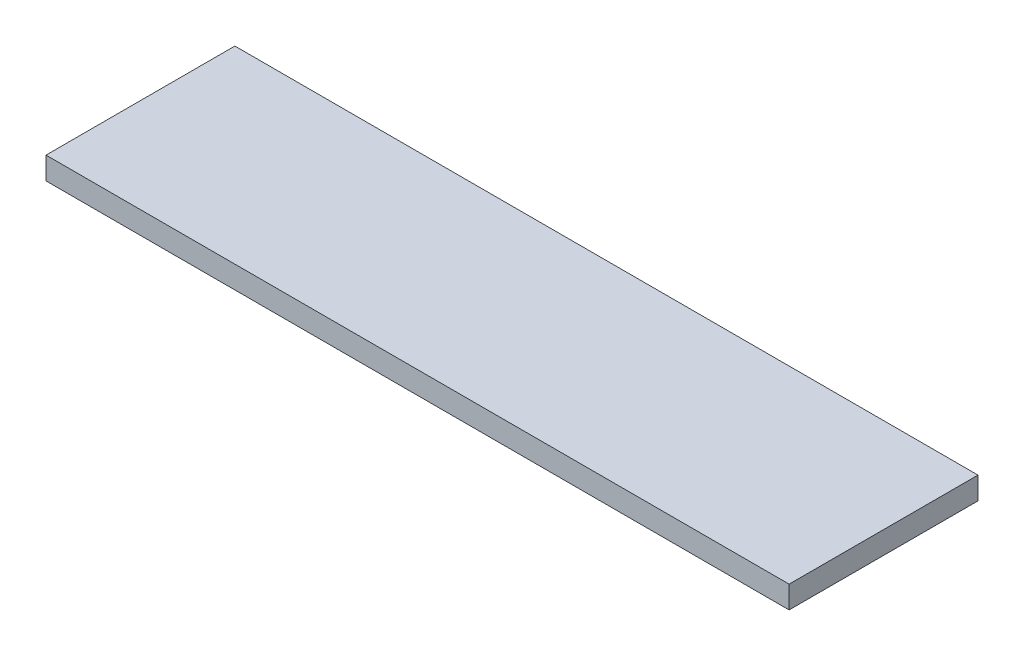
ISO-10303-21;
HEADER;
FILE_DESCRIPTION(('STEP AP214'),'2;1');
FILE_NAME('part.step','',(''),(''),'','','');
FILE_SCHEMA(('AUTOMOTIVE_DESIGN { 1 0 10303 214 1 1 1 1 }'));
ENDSEC;
DATA;
#1=APPLICATION_CONTEXT('core data for automotive mechanical design processes');
#2=APPLICATION_PROTOCOL_DEFINITION('international standard','automotive_design',2000,#1);
#3=PRODUCT_CONTEXT('',#1,'mechanical');
#4=PRODUCT('Part','Part','',(#3));
#5=PRODUCT_RELATED_PRODUCT_CATEGORY('part','',(#4));
#6=PRODUCT_DEFINITION_FORMATION('','',#4);
#7=PRODUCT_DEFINITION_CONTEXT('part definition',#1,'design');
#8=PRODUCT_DEFINITION('design','',#6,#7);
#9=PRODUCT_DEFINITION_SHAPE('','',#8);
#10=(LENGTH_UNIT() NAMED_UNIT(*) SI_UNIT(.MILLI.,.METRE.));
#11=(NAMED_UNIT(*) PLANE_ANGLE_UNIT() SI_UNIT($,.RADIAN.));
#12=(NAMED_UNIT(*) SI_UNIT($,.STERADIAN.) SOLID_ANGLE_UNIT());
#13=UNCERTAINTY_MEASURE_WITH_UNIT(LENGTH_MEASURE(1.E-05),#10,'distance_accuracy_value','');
#14=(GEOMETRIC_REPRESENTATION_CONTEXT(3) GLOBAL_UNCERTAINTY_ASSIGNED_CONTEXT((#13)) GLOBAL_UNIT_ASSIGNED_CONTEXT((#10,
#11,#12)) REPRESENTATION_CONTEXT('',''));
#15=CARTESIAN_POINT('',(0.,0.,0.));
#16=DIRECTION('',(0.,0.,1.));
#17=DIRECTION('',(1.,0.,0.));
#18=AXIS2_PLACEMENT_3D('',#15,#16,#17);
#19=CARTESIAN_POINT('',(-299.,18.,76.));
#20=DIRECTION('',(1.,0.,0.));
#21=DIRECTION('',(0.,0.,-1.));
#22=AXIS2_PLACEMENT_3D('',#19,#20,#21);
#23=PLANE('',#22);
#24=DIRECTION('',(0.,0.,1.));
#25=VECTOR('',#24,1.);
#26=CARTESIAN_POINT('',(-299.,0.,76.));
#27=LINE('',#26,#25);
#28=CARTESIAN_POINT('',(-299.,0.,-76.));
#29=VERTEX_POINT('',#28);
#30=CARTESIAN_POINT('',(-299.,0.,76.));
#31=VERTEX_POINT('',#30);
#32=EDGE_CURVE('E98',#29,#31,#27,.T.);
#33=ORIENTED_EDGE('',*,*,#32,.T.);
#34=DIRECTION('',(0.,-1.,0.));
#35=VECTOR('',#34,1.);
#36=CARTESIAN_POINT('',(-299.,18.,76.));
#37=LINE('',#36,#35);
#38=CARTESIAN_POINT('',(-299.,18.,76.));
#39=VERTEX_POINT('',#38);
#40=EDGE_CURVE('E11',#39,#31,#37,.T.);
#41=ORIENTED_EDGE('',*,*,#40,.F.);
#42=DIRECTION('',(0.,0.,1.));
#43=VECTOR('',#42,1.);
#44=CARTESIAN_POINT('',(-299.,18.,76.));
#45=LINE('',#44,#43);
#46=CARTESIAN_POINT('',(-299.,18.,-76.));
#47=VERTEX_POINT('',#46);
#48=EDGE_CURVE('E86',#47,#39,#45,.T.);
#49=ORIENTED_EDGE('',*,*,#48,.F.);
#50=DIRECTION('',(0.,-1.,0.));
#51=VECTOR('',#50,1.);
#52=CARTESIAN_POINT('',(-299.,18.,-76.));
#53=LINE('',#52,#51);
#54=EDGE_CURVE('E94',#47,#29,#53,.T.);
#55=ORIENTED_EDGE('',*,*,#54,.T.);
#56=EDGE_LOOP('',(#33,#41,#49,#55));
#57=FACE_BOUND('',#56,.T.);
#58=ADVANCED_FACE('F35',(#57),#23,.F.);
#59=CARTESIAN_POINT('',(299.,18.,76.));
#60=DIRECTION('',(0.,0.,-1.));
#61=DIRECTION('',(-1.,0.,0.));
#62=AXIS2_PLACEMENT_3D('',#59,#60,#61);
#63=PLANE('',#62);
#64=DIRECTION('',(1.,0.,0.));
#65=VECTOR('',#64,1.);
#66=CARTESIAN_POINT('',(299.,0.,76.));
#67=LINE('',#66,#65);
#68=CARTESIAN_POINT('',(299.,0.,76.));
#69=VERTEX_POINT('',#68);
#70=EDGE_CURVE('E90',#31,#69,#67,.T.);
#71=ORIENTED_EDGE('',*,*,#70,.T.);
#72=DIRECTION('',(0.,-1.,0.));
#73=VECTOR('',#72,1.);
#74=CARTESIAN_POINT('',(299.,18.,76.));
#75=LINE('',#74,#73);
#76=CARTESIAN_POINT('',(299.,18.,76.));
#77=VERTEX_POINT('',#76);
#78=EDGE_CURVE('E43',#77,#69,#75,.T.);
#79=ORIENTED_EDGE('',*,*,#78,.F.);
#80=DIRECTION('',(1.,0.,0.));
#81=VECTOR('',#80,1.);
#82=CARTESIAN_POINT('',(299.,18.,76.));
#83=LINE('',#82,#81);
#84=EDGE_CURVE('E81',#39,#77,#83,.T.);
#85=ORIENTED_EDGE('',*,*,#84,.F.);
#86=ORIENTED_EDGE('',*,*,#40,.T.);
#87=EDGE_LOOP('',(#71,#79,#85,#86));
#88=FACE_BOUND('',#87,.T.);
#89=ADVANCED_FACE('F89',(#88),#63,.F.);
#90=CARTESIAN_POINT('',(299.,18.,76.));
#91=DIRECTION('',(-1.,0.,0.));
#92=DIRECTION('',(0.,0.,1.));
#93=AXIS2_PLACEMENT_3D('',#90,#91,#92);
#94=PLANE('',#93);
#95=DIRECTION('',(0.,0.,-1.));
#96=VECTOR('',#95,1.);
#97=CARTESIAN_POINT('',(299.,0.,76.));
#98=LINE('',#97,#96);
#99=CARTESIAN_POINT('',(299.,0.,-76.));
#100=VERTEX_POINT('',#99);
#101=EDGE_CURVE('E68',#69,#100,#98,.T.);
#102=ORIENTED_EDGE('',*,*,#101,.T.);
#103=DIRECTION('',(0.,-1.,0.));
#104=VECTOR('',#103,1.);
#105=CARTESIAN_POINT('',(299.,18.,-76.));
#106=LINE('',#105,#104);
#107=CARTESIAN_POINT('',(299.,18.,-76.));
#108=VERTEX_POINT('',#107);
#109=EDGE_CURVE('E91',#108,#100,#106,.T.);
#110=ORIENTED_EDGE('',*,*,#109,.F.);
#111=DIRECTION('',(0.,0.,-1.));
#112=VECTOR('',#111,1.);
#113=CARTESIAN_POINT('',(299.,18.,76.));
#114=LINE('',#113,#112);
#115=EDGE_CURVE('E84',#77,#108,#114,.T.);
#116=ORIENTED_EDGE('',*,*,#115,.F.);
#117=ORIENTED_EDGE('',*,*,#78,.T.);
#118=EDGE_LOOP('',(#102,#110,#116,#117));
#119=FACE_BOUND('',#118,.T.);
#120=ADVANCED_FACE('F92',(#119),#94,.F.);
#121=CARTESIAN_POINT('',(299.,18.,-76.));
#122=DIRECTION('',(0.,0.,1.));
#123=DIRECTION('',(1.,0.,0.));
#124=AXIS2_PLACEMENT_3D('',#121,#122,#123);
#125=PLANE('',#124);
#126=DIRECTION('',(-1.,0.,0.));
#127=VECTOR('',#126,1.);
#128=CARTESIAN_POINT('',(299.,0.,-76.));
#129=LINE('',#128,#127);
#130=EDGE_CURVE('E74',#100,#29,#129,.T.);
#131=ORIENTED_EDGE('',*,*,#130,.T.);
#132=ORIENTED_EDGE('',*,*,#54,.F.);
#133=DIRECTION('',(-1.,0.,0.));
#134=VECTOR('',#133,1.);
#135=CARTESIAN_POINT('',(299.,18.,-76.));
#136=LINE('',#135,#134);
#137=EDGE_CURVE('E51',#108,#47,#136,.T.);
#138=ORIENTED_EDGE('',*,*,#137,.F.);
#139=ORIENTED_EDGE('',*,*,#109,.T.);
#140=EDGE_LOOP('',(#131,#132,#138,#139));
#141=FACE_BOUND('',#140,.T.);
#142=ADVANCED_FACE('F105',(#141),#125,.F.);
#143=CARTESIAN_POINT('',(0.,18.,0.));
#144=DIRECTION('',(0.,1.,0.));
#145=DIRECTION('',(0.,0.,1.));
#146=AXIS2_PLACEMENT_3D('',#143,#144,#145);
#147=PLANE('',#146);
#148=ORIENTED_EDGE('',*,*,#48,.T.);
#149=ORIENTED_EDGE('',*,*,#84,.T.);
#150=ORIENTED_EDGE('',*,*,#115,.T.);
#151=ORIENTED_EDGE('',*,*,#137,.T.);
#152=EDGE_LOOP('',(#148,#149,#150,#151));
#153=FACE_BOUND('',#152,.T.);
#154=ADVANCED_FACE('F82',(#153),#147,.T.);
#155=CARTESIAN_POINT('',(0.,0.,0.));
#156=DIRECTION('',(0.,1.,0.));
#157=DIRECTION('',(0.,0.,1.));
#158=AXIS2_PLACEMENT_3D('',#155,#156,#157);
#159=PLANE('',#158);
#160=ORIENTED_EDGE('',*,*,#32,.F.);
#161=ORIENTED_EDGE('',*,*,#130,.F.);
#162=ORIENTED_EDGE('',*,*,#101,.F.);
#163=ORIENTED_EDGE('',*,*,#70,.F.);
#164=EDGE_LOOP('',(#160,#161,#162,#163));
#165=FACE_BOUND('',#164,.T.);
#166=ADVANCED_FACE('F108',(#165),#159,.F.);
#167=CLOSED_SHELL('',(#58,#89,#120,#142,#154,#166));
#168=MANIFOLD_SOLID_BREP('B2',#167);
#169=ADVANCED_BREP_SHAPE_REPRESENTATION('',(#18,#168),#14);
#170=SHAPE_DEFINITION_REPRESENTATION(#9,#169);
ENDSEC;
END-ISO-10303-21;
